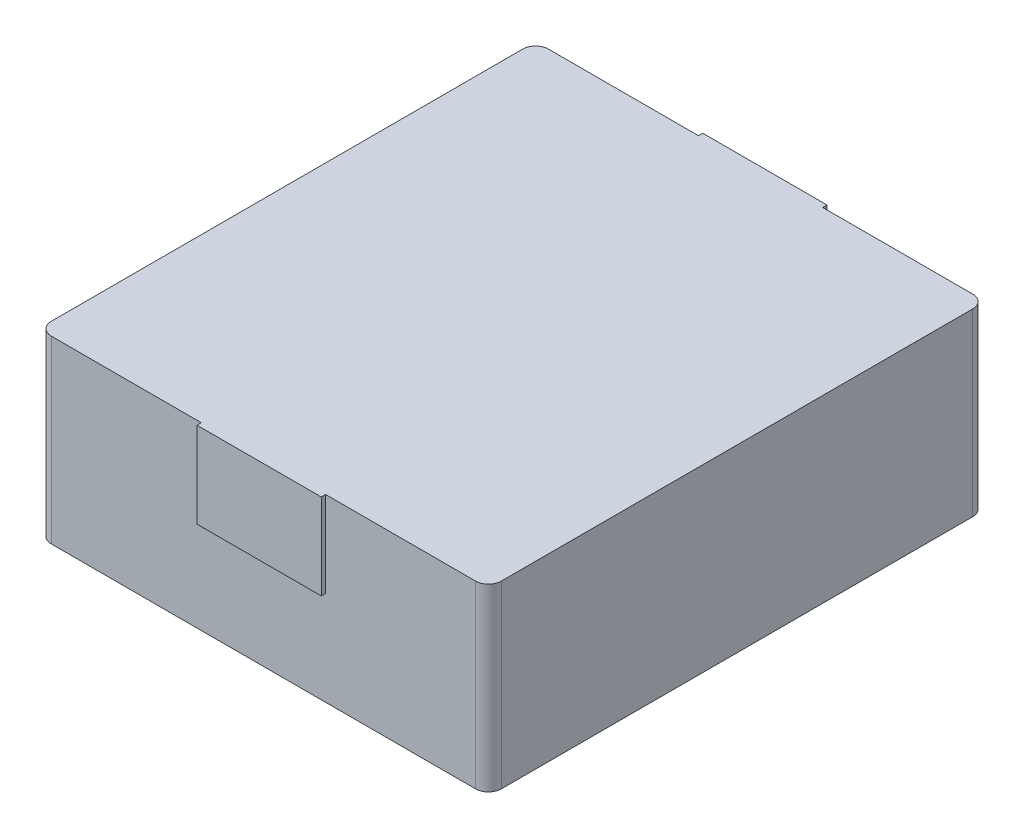
ISO-10303-21;
HEADER;
FILE_DESCRIPTION(('STEP AP214'),'2;1');
FILE_NAME('part.step','',(''),(''),'','','');
FILE_SCHEMA(('AUTOMOTIVE_DESIGN { 1 0 10303 214 1 1 1 1 }'));
ENDSEC;
DATA;
#1=APPLICATION_CONTEXT('core data for automotive mechanical design processes');
#2=APPLICATION_PROTOCOL_DEFINITION('international standard','automotive_design',2000,#1);
#3=PRODUCT_CONTEXT('',#1,'mechanical');
#4=PRODUCT('Part','Part','',(#3));
#5=PRODUCT_RELATED_PRODUCT_CATEGORY('part','',(#4));
#6=PRODUCT_DEFINITION_FORMATION('','',#4);
#7=PRODUCT_DEFINITION_CONTEXT('part definition',#1,'design');
#8=PRODUCT_DEFINITION('design','',#6,#7);
#9=PRODUCT_DEFINITION_SHAPE('','',#8);
#10=(LENGTH_UNIT() NAMED_UNIT(*) SI_UNIT(.MILLI.,.METRE.));
#11=(NAMED_UNIT(*) PLANE_ANGLE_UNIT() SI_UNIT($,.RADIAN.));
#12=(NAMED_UNIT(*) SI_UNIT($,.STERADIAN.) SOLID_ANGLE_UNIT());
#13=UNCERTAINTY_MEASURE_WITH_UNIT(LENGTH_MEASURE(1.E-05),#10,'distance_accuracy_value','');
#14=(GEOMETRIC_REPRESENTATION_CONTEXT(3) GLOBAL_UNCERTAINTY_ASSIGNED_CONTEXT((#13)) GLOBAL_UNIT_ASSIGNED_CONTEXT((#10,
#11,#12)) REPRESENTATION_CONTEXT('',''));
#15=CARTESIAN_POINT('',(0.,0.,0.));
#16=DIRECTION('',(0.,0.,1.));
#17=DIRECTION('',(1.,0.,0.));
#18=AXIS2_PLACEMENT_3D('',#15,#16,#17);
#19=CARTESIAN_POINT('',(24.35,5.75,-11.25));
#20=DIRECTION('',(0.,1.,0.));
#21=DIRECTION('',(0.,0.,-1.));
#22=AXIS2_PLACEMENT_3D('',#19,#20,#21);
#23=PLANE('',#22);
#24=DIRECTION('',(0.,0.,-1.));
#25=VECTOR('',#24,1.);
#26=CARTESIAN_POINT('',(21.45,5.75,-11.3));
#27=LINE('',#26,#25);
#28=CARTESIAN_POINT('',(21.45,5.75,-11.25));
#29=VERTEX_POINT('',#28);
#30=CARTESIAN_POINT('',(21.45,5.75,-11.35));
#31=VERTEX_POINT('',#30);
#32=EDGE_CURVE('E200',#29,#31,#27,.T.);
#33=ORIENTED_EDGE('',*,*,#32,.T.);
#34=DIRECTION('',(-1.,0.,0.));
#35=VECTOR('',#34,1.);
#36=CARTESIAN_POINT('',(22.9,5.75,-11.35));
#37=LINE('',#36,#35);
#38=CARTESIAN_POINT('',(24.35,5.75,-11.35));
#39=VERTEX_POINT('',#38);
#40=EDGE_CURVE('E152',#39,#31,#37,.T.);
#41=ORIENTED_EDGE('',*,*,#40,.F.);
#42=DIRECTION('',(0.,0.,1.));
#43=VECTOR('',#42,1.);
#44=CARTESIAN_POINT('',(24.35,5.75,-11.3));
#45=LINE('',#44,#43);
#46=CARTESIAN_POINT('',(24.35,5.75,-11.25));
#47=VERTEX_POINT('',#46);
#48=EDGE_CURVE('E199',#39,#47,#45,.T.);
#49=ORIENTED_EDGE('',*,*,#48,.T.);
#50=DIRECTION('',(-1.,0.,0.));
#51=VECTOR('',#50,1.);
#52=CARTESIAN_POINT('',(22.9,5.75,-11.25));
#53=LINE('',#52,#51);
#54=EDGE_CURVE('E240',#47,#29,#53,.T.);
#55=ORIENTED_EDGE('',*,*,#54,.T.);
#56=EDGE_LOOP('',(#33,#41,#49,#55));
#57=FACE_BOUND('',#56,.T.);
#58=ADVANCED_FACE('F17',(#57),#23,.F.);
#59=CARTESIAN_POINT('',(21.45,7.75,-11.35));
#60=DIRECTION('',(1.,0.,0.));
#61=DIRECTION('',(0.,0.,1.));
#62=AXIS2_PLACEMENT_3D('',#59,#60,#61);
#63=PLANE('',#62);
#64=ORIENTED_EDGE('',*,*,#32,.F.);
#65=DIRECTION('',(0.,1.,0.));
#66=VECTOR('',#65,1.);
#67=CARTESIAN_POINT('',(21.45,6.75,-11.25));
#68=LINE('',#67,#66);
#69=CARTESIAN_POINT('',(21.45,7.75,-11.25));
#70=VERTEX_POINT('',#69);
#71=EDGE_CURVE('E209',#29,#70,#68,.T.);
#72=ORIENTED_EDGE('',*,*,#71,.T.);
#73=DIRECTION('',(0.,0.,1.));
#74=VECTOR('',#73,1.);
#75=CARTESIAN_POINT('',(21.45,7.75,-11.3));
#76=LINE('',#75,#74);
#77=CARTESIAN_POINT('',(21.45,7.75,-11.35));
#78=VERTEX_POINT('',#77);
#79=EDGE_CURVE('E71',#78,#70,#76,.T.);
#80=ORIENTED_EDGE('',*,*,#79,.F.);
#81=DIRECTION('',(0.,1.,0.));
#82=VECTOR('',#81,1.);
#83=CARTESIAN_POINT('',(21.45,5.65,-11.35));
#84=LINE('',#83,#82);
#85=EDGE_CURVE('E150',#31,#78,#84,.T.);
#86=ORIENTED_EDGE('',*,*,#85,.F.);
#87=EDGE_LOOP('',(#64,#72,#80,#86));
#88=FACE_BOUND('',#87,.T.);
#89=ADVANCED_FACE('F327',(#88),#63,.F.);
#90=CARTESIAN_POINT('',(24.35,7.75,-11.25));
#91=DIRECTION('',(-1.,0.,0.));
#92=DIRECTION('',(0.,0.,-1.));
#93=AXIS2_PLACEMENT_3D('',#90,#91,#92);
#94=PLANE('',#93);
#95=ORIENTED_EDGE('',*,*,#48,.F.);
#96=DIRECTION('',(0.,-1.,0.));
#97=VECTOR('',#96,1.);
#98=CARTESIAN_POINT('',(24.35,5.65,-11.35));
#99=LINE('',#98,#97);
#100=CARTESIAN_POINT('',(24.35,7.75,-11.35));
#101=VERTEX_POINT('',#100);
#102=EDGE_CURVE('E146',#101,#39,#99,.T.);
#103=ORIENTED_EDGE('',*,*,#102,.F.);
#104=DIRECTION('',(0.,0.,-1.));
#105=VECTOR('',#104,1.);
#106=CARTESIAN_POINT('',(24.35,7.75,-11.3));
#107=LINE('',#106,#105);
#108=CARTESIAN_POINT('',(24.35,7.75,-11.25));
#109=VERTEX_POINT('',#108);
#110=EDGE_CURVE('E196',#109,#101,#107,.T.);
#111=ORIENTED_EDGE('',*,*,#110,.F.);
#112=DIRECTION('',(0.,-1.,0.));
#113=VECTOR('',#112,1.);
#114=CARTESIAN_POINT('',(24.35,6.75,-11.25));
#115=LINE('',#114,#113);
#116=EDGE_CURVE('E243',#109,#47,#115,.T.);
#117=ORIENTED_EDGE('',*,*,#116,.T.);
#118=EDGE_LOOP('',(#95,#103,#111,#117));
#119=FACE_BOUND('',#118,.T.);
#120=ADVANCED_FACE('F317',(#119),#94,.F.);
#121=CARTESIAN_POINT('',(17.95,3.55,-11.65));
#122=DIRECTION('',(0.,1.,0.));
#123=DIRECTION('',(0.,0.,1.));
#124=AXIS2_PLACEMENT_3D('',#121,#122,#123);
#125=CYLINDRICAL_SURFACE('',#124,0.300000000000002);
#126=CARTESIAN_POINT('',(17.95,3.55,-11.65));
#127=DIRECTION('',(0.,1.,0.));
#128=DIRECTION('',(0.,0.,1.));
#129=AXIS2_PLACEMENT_3D('',#126,#127,#128);
#130=CIRCLE('',#129,0.300000000000002);
#131=CARTESIAN_POINT('',(17.95,3.55,-11.35));
#132=VERTEX_POINT('',#131);
#133=CARTESIAN_POINT('',(17.65,3.55,-11.65));
#134=VERTEX_POINT('',#133);
#135=EDGE_CURVE('E248',#132,#134,#130,.F.);
#136=ORIENTED_EDGE('',*,*,#135,.F.);
#137=DIRECTION('',(0.,-1.,0.));
#138=VECTOR('',#137,1.);
#139=CARTESIAN_POINT('',(17.95,5.65,-11.35));
#140=LINE('',#139,#138);
#141=CARTESIAN_POINT('',(17.95,7.75,-11.35));
#142=VERTEX_POINT('',#141);
#143=EDGE_CURVE('E147',#142,#132,#140,.T.);
#144=ORIENTED_EDGE('',*,*,#143,.F.);
#145=CARTESIAN_POINT('',(17.95,7.75,-11.65));
#146=DIRECTION('',(0.,1.,0.));
#147=DIRECTION('',(0.,0.,1.));
#148=AXIS2_PLACEMENT_3D('',#145,#146,#147);
#149=CIRCLE('',#148,0.300000000000002);
#150=CARTESIAN_POINT('',(17.65,7.75,-11.65));
#151=VERTEX_POINT('',#150);
#152=EDGE_CURVE('E21',#151,#142,#149,.T.);
#153=ORIENTED_EDGE('',*,*,#152,.F.);
#154=DIRECTION('',(0.,1.,0.));
#155=VECTOR('',#154,1.);
#156=CARTESIAN_POINT('',(17.65,5.65,-11.65));
#157=LINE('',#156,#155);
#158=EDGE_CURVE('E141',#134,#151,#157,.T.);
#159=ORIENTED_EDGE('',*,*,#158,.F.);
#160=EDGE_LOOP('',(#136,#144,#153,#159));
#161=FACE_BOUND('',#160,.T.);
#162=ADVANCED_FACE('F314',(#161),#125,.T.);
#163=CARTESIAN_POINT('',(24.35,5.75,-23.05));
#164=DIRECTION('',(0.,-1.,0.));
#165=DIRECTION('',(0.,0.,1.));
#166=AXIS2_PLACEMENT_3D('',#163,#164,#165);
#167=PLANE('',#166);
#168=DIRECTION('',(-1.,0.,0.));
#169=VECTOR('',#168,1.);
#170=CARTESIAN_POINT('',(22.9,5.75,-23.05));
#171=LINE('',#170,#169);
#172=CARTESIAN_POINT('',(24.35,5.75,-23.05));
#173=VERTEX_POINT('',#172);
#174=CARTESIAN_POINT('',(21.45,5.75,-23.05));
#175=VERTEX_POINT('',#174);
#176=EDGE_CURVE('E221',#173,#175,#171,.T.);
#177=ORIENTED_EDGE('',*,*,#176,.F.);
#178=DIRECTION('',(0.,0.,-1.));
#179=VECTOR('',#178,1.);
#180=CARTESIAN_POINT('',(24.35,5.75,-23.));
#181=LINE('',#180,#179);
#182=CARTESIAN_POINT('',(24.35,5.75,-22.95));
#183=VERTEX_POINT('',#182);
#184=EDGE_CURVE('E188',#183,#173,#181,.T.);
#185=ORIENTED_EDGE('',*,*,#184,.F.);
#186=DIRECTION('',(1.,0.,0.));
#187=VECTOR('',#186,1.);
#188=CARTESIAN_POINT('',(22.9,5.75,-22.95));
#189=LINE('',#188,#187);
#190=CARTESIAN_POINT('',(21.45,5.75,-22.95));
#191=VERTEX_POINT('',#190);
#192=EDGE_CURVE('E178',#191,#183,#189,.T.);
#193=ORIENTED_EDGE('',*,*,#192,.F.);
#194=DIRECTION('',(0.,0.,1.));
#195=VECTOR('',#194,1.);
#196=CARTESIAN_POINT('',(21.45,5.75,-23.));
#197=LINE('',#196,#195);
#198=EDGE_CURVE('E170',#175,#191,#197,.T.);
#199=ORIENTED_EDGE('',*,*,#198,.F.);
#200=EDGE_LOOP('',(#177,#185,#193,#199));
#201=FACE_BOUND('',#200,.T.);
#202=ADVANCED_FACE('F316',(#201),#167,.T.);
#203=CARTESIAN_POINT('',(24.35,7.75,-23.05));
#204=DIRECTION('',(1.,0.,0.));
#205=DIRECTION('',(0.,0.,1.));
#206=AXIS2_PLACEMENT_3D('',#203,#204,#205);
#207=PLANE('',#206);
#208=DIRECTION('',(0.,-1.,0.));
#209=VECTOR('',#208,1.);
#210=CARTESIAN_POINT('',(24.35,6.75,-23.05));
#211=LINE('',#210,#209);
#212=CARTESIAN_POINT('',(24.35,7.75,-23.05));
#213=VERTEX_POINT('',#212);
#214=EDGE_CURVE('E143',#213,#173,#211,.T.);
#215=ORIENTED_EDGE('',*,*,#214,.F.);
#216=DIRECTION('',(0.,0.,1.));
#217=VECTOR('',#216,1.);
#218=CARTESIAN_POINT('',(24.35,7.75,-23.));
#219=LINE('',#218,#217);
#220=CARTESIAN_POINT('',(24.35,7.75,-22.95));
#221=VERTEX_POINT('',#220);
#222=EDGE_CURVE('E185',#213,#221,#219,.T.);
#223=ORIENTED_EDGE('',*,*,#222,.T.);
#224=DIRECTION('',(0.,1.,0.));
#225=VECTOR('',#224,1.);
#226=CARTESIAN_POINT('',(24.35,5.65,-22.95));
#227=LINE('',#226,#225);
#228=EDGE_CURVE('E181',#183,#221,#227,.T.);
#229=ORIENTED_EDGE('',*,*,#228,.F.);
#230=ORIENTED_EDGE('',*,*,#184,.T.);
#231=EDGE_LOOP('',(#215,#223,#229,#230));
#232=FACE_BOUND('',#231,.T.);
#233=ADVANCED_FACE('F324',(#232),#207,.T.);
#234=CARTESIAN_POINT('',(17.95,3.55,-22.65));
#235=DIRECTION('',(0.,1.,0.));
#236=DIRECTION('',(-1.,0.,0.));
#237=AXIS2_PLACEMENT_3D('',#234,#235,#236);
#238=CYLINDRICAL_SURFACE('',#237,0.299999999999995);
#239=CARTESIAN_POINT('',(17.95,3.55,-22.65));
#240=DIRECTION('',(0.,1.,0.));
#241=DIRECTION('',(-1.,0.,0.));
#242=AXIS2_PLACEMENT_3D('',#239,#240,#241);
#243=CIRCLE('',#242,0.299999999999995);
#244=CARTESIAN_POINT('',(17.65,3.55,-22.65));
#245=VERTEX_POINT('',#244);
#246=CARTESIAN_POINT('',(17.95,3.55,-22.95));
#247=VERTEX_POINT('',#246);
#248=EDGE_CURVE('E106',#245,#247,#243,.F.);
#249=ORIENTED_EDGE('',*,*,#248,.F.);
#250=DIRECTION('',(0.,-1.,0.));
#251=VECTOR('',#250,1.);
#252=CARTESIAN_POINT('',(17.65,5.65,-22.65));
#253=LINE('',#252,#251);
#254=CARTESIAN_POINT('',(17.65,7.75,-22.65));
#255=VERTEX_POINT('',#254);
#256=EDGE_CURVE('E144',#255,#245,#253,.T.);
#257=ORIENTED_EDGE('',*,*,#256,.F.);
#258=CARTESIAN_POINT('',(17.95,7.75,-22.65));
#259=DIRECTION('',(0.,1.,0.));
#260=DIRECTION('',(-1.,0.,0.));
#261=AXIS2_PLACEMENT_3D('',#258,#259,#260);
#262=CIRCLE('',#261,0.299999999999995);
#263=CARTESIAN_POINT('',(17.95,7.75,-22.95));
#264=VERTEX_POINT('',#263);
#265=EDGE_CURVE('E129',#264,#255,#262,.T.);
#266=ORIENTED_EDGE('',*,*,#265,.F.);
#267=DIRECTION('',(0.,1.,0.));
#268=VECTOR('',#267,1.);
#269=CARTESIAN_POINT('',(17.95,5.65,-22.95));
#270=LINE('',#269,#268);
#271=EDGE_CURVE('E121',#247,#264,#270,.T.);
#272=ORIENTED_EDGE('',*,*,#271,.F.);
#273=EDGE_LOOP('',(#249,#257,#266,#272));
#274=FACE_BOUND('',#273,.T.);
#275=ADVANCED_FACE('F128',(#274),#238,.T.);
#276=CARTESIAN_POINT('',(21.45,7.75,-22.95));
#277=DIRECTION('',(-1.,0.,0.));
#278=DIRECTION('',(0.,0.,-1.));
#279=AXIS2_PLACEMENT_3D('',#276,#277,#278);
#280=PLANE('',#279);
#281=DIRECTION('',(0.,1.,0.));
#282=VECTOR('',#281,1.);
#283=CARTESIAN_POINT('',(21.45,6.75,-23.05));
#284=LINE('',#283,#282);
#285=CARTESIAN_POINT('',(21.45,7.75,-23.05));
#286=VERTEX_POINT('',#285);
#287=EDGE_CURVE('E182',#175,#286,#284,.T.);
#288=ORIENTED_EDGE('',*,*,#287,.F.);
#289=ORIENTED_EDGE('',*,*,#198,.T.);
#290=DIRECTION('',(0.,-1.,0.));
#291=VECTOR('',#290,1.);
#292=CARTESIAN_POINT('',(21.45,5.65,-22.95));
#293=LINE('',#292,#291);
#294=CARTESIAN_POINT('',(21.45,7.75,-22.95));
#295=VERTEX_POINT('',#294);
#296=EDGE_CURVE('E130',#295,#191,#293,.T.);
#297=ORIENTED_EDGE('',*,*,#296,.F.);
#298=DIRECTION('',(0.,0.,-1.));
#299=VECTOR('',#298,1.);
#300=CARTESIAN_POINT('',(21.45,7.75,-23.));
#301=LINE('',#300,#299);
#302=EDGE_CURVE('E167',#295,#286,#301,.T.);
#303=ORIENTED_EDGE('',*,*,#302,.T.);
#304=EDGE_LOOP('',(#288,#289,#297,#303));
#305=FACE_BOUND('',#304,.T.);
#306=ADVANCED_FACE('F355',(#305),#280,.T.);
#307=CARTESIAN_POINT('',(27.85,3.55,-22.65));
#308=DIRECTION('',(0.,1.,0.));
#309=DIRECTION('',(0.,0.,1.));
#310=AXIS2_PLACEMENT_3D('',#307,#308,#309);
#311=CYLINDRICAL_SURFACE('',#310,0.299999999999991);
#312=CARTESIAN_POINT('',(27.85,3.55,-22.65));
#313=DIRECTION('',(0.,1.,0.));
#314=DIRECTION('',(0.,0.,1.));
#315=AXIS2_PLACEMENT_3D('',#312,#313,#314);
#316=CIRCLE('',#315,0.299999999999991);
#317=CARTESIAN_POINT('',(27.85,3.55,-22.95));
#318=VERTEX_POINT('',#317);
#319=CARTESIAN_POINT('',(28.15,3.55,-22.65));
#320=VERTEX_POINT('',#319);
#321=EDGE_CURVE('E115',#318,#320,#316,.F.);
#322=ORIENTED_EDGE('',*,*,#321,.F.);
#323=DIRECTION('',(0.,-1.,0.));
#324=VECTOR('',#323,1.);
#325=CARTESIAN_POINT('',(27.85,5.65,-22.95));
#326=LINE('',#325,#324);
#327=CARTESIAN_POINT('',(27.85,7.75,-22.95));
#328=VERTEX_POINT('',#327);
#329=EDGE_CURVE('E125',#328,#318,#326,.T.);
#330=ORIENTED_EDGE('',*,*,#329,.F.);
#331=CARTESIAN_POINT('',(27.85,7.75,-22.65));
#332=DIRECTION('',(0.,1.,0.));
#333=DIRECTION('',(0.,0.,1.));
#334=AXIS2_PLACEMENT_3D('',#331,#332,#333);
#335=CIRCLE('',#334,0.299999999999991);
#336=CARTESIAN_POINT('',(28.15,7.75,-22.65));
#337=VERTEX_POINT('',#336);
#338=EDGE_CURVE('E175',#337,#328,#335,.T.);
#339=ORIENTED_EDGE('',*,*,#338,.F.);
#340=DIRECTION('',(0.,1.,0.));
#341=VECTOR('',#340,1.);
#342=CARTESIAN_POINT('',(28.15,5.65,-22.65));
#343=LINE('',#342,#341);
#344=EDGE_CURVE('E133',#320,#337,#343,.T.);
#345=ORIENTED_EDGE('',*,*,#344,.F.);
#346=EDGE_LOOP('',(#322,#330,#339,#345));
#347=FACE_BOUND('',#346,.T.);
#348=ADVANCED_FACE('F302',(#347),#311,.T.);
#349=CARTESIAN_POINT('',(27.85,3.55,-11.65));
#350=DIRECTION('',(0.,1.,0.));
#351=DIRECTION('',(-1.,0.,0.));
#352=AXIS2_PLACEMENT_3D('',#349,#350,#351);
#353=CYLINDRICAL_SURFACE('',#352,0.3);
#354=CARTESIAN_POINT('',(27.85,3.55,-11.65));
#355=DIRECTION('',(0.,1.,0.));
#356=DIRECTION('',(-1.,0.,0.));
#357=AXIS2_PLACEMENT_3D('',#354,#355,#356);
#358=CIRCLE('',#357,0.3);
#359=CARTESIAN_POINT('',(28.15,3.55,-11.65));
#360=VERTEX_POINT('',#359);
#361=CARTESIAN_POINT('',(27.85,3.55,-11.35));
#362=VERTEX_POINT('',#361);
#363=EDGE_CURVE('E261',#360,#362,#358,.F.);
#364=ORIENTED_EDGE('',*,*,#363,.F.);
#365=DIRECTION('',(0.,-1.,0.));
#366=VECTOR('',#365,1.);
#367=CARTESIAN_POINT('',(28.15,5.65,-11.65));
#368=LINE('',#367,#366);
#369=CARTESIAN_POINT('',(28.15,7.75,-11.65));
#370=VERTEX_POINT('',#369);
#371=EDGE_CURVE('E166',#370,#360,#368,.T.);
#372=ORIENTED_EDGE('',*,*,#371,.F.);
#373=CARTESIAN_POINT('',(27.85,7.75,-11.65));
#374=DIRECTION('',(0.,1.,0.));
#375=DIRECTION('',(-1.,0.,0.));
#376=AXIS2_PLACEMENT_3D('',#373,#374,#375);
#377=CIRCLE('',#376,0.3);
#378=CARTESIAN_POINT('',(27.85,7.75,-11.35));
#379=VERTEX_POINT('',#378);
#380=EDGE_CURVE('E36',#379,#370,#377,.T.);
#381=ORIENTED_EDGE('',*,*,#380,.F.);
#382=DIRECTION('',(0.,1.,0.));
#383=VECTOR('',#382,1.);
#384=CARTESIAN_POINT('',(27.85,5.65,-11.35));
#385=LINE('',#384,#383);
#386=EDGE_CURVE('E155',#362,#379,#385,.T.);
#387=ORIENTED_EDGE('',*,*,#386,.F.);
#388=EDGE_LOOP('',(#364,#372,#381,#387));
#389=FACE_BOUND('',#388,.T.);
#390=ADVANCED_FACE('F309',(#389),#353,.T.);
#391=CARTESIAN_POINT('',(28.25605,3.55,-23.066));
#392=DIRECTION('',(0.,-1.,0.));
#393=DIRECTION('',(0.,0.,1.));
#394=AXIS2_PLACEMENT_3D('',#391,#392,#393);
#395=PLANE('',#394);
#396=ORIENTED_EDGE('',*,*,#135,.T.);
#397=DIRECTION('',(0.,0.,1.));
#398=VECTOR('',#397,1.);
#399=CARTESIAN_POINT('',(17.65,3.55,-17.15));
#400=LINE('',#399,#398);
#401=EDGE_CURVE('E111',#245,#134,#400,.T.);
#402=ORIENTED_EDGE('',*,*,#401,.F.);
#403=ORIENTED_EDGE('',*,*,#248,.T.);
#404=DIRECTION('',(-1.,0.,0.));
#405=VECTOR('',#404,1.);
#406=CARTESIAN_POINT('',(22.9,3.55,-22.95));
#407=LINE('',#406,#405);
#408=EDGE_CURVE('E109',#318,#247,#407,.T.);
#409=ORIENTED_EDGE('',*,*,#408,.F.);
#410=ORIENTED_EDGE('',*,*,#321,.T.);
#411=DIRECTION('',(0.,0.,-1.));
#412=VECTOR('',#411,1.);
#413=CARTESIAN_POINT('',(28.15,3.55,-17.15));
#414=LINE('',#413,#412);
#415=EDGE_CURVE('E162',#360,#320,#414,.T.);
#416=ORIENTED_EDGE('',*,*,#415,.F.);
#417=ORIENTED_EDGE('',*,*,#363,.T.);
#418=DIRECTION('',(1.,0.,0.));
#419=VECTOR('',#418,1.);
#420=CARTESIAN_POINT('',(22.9,3.55,-11.35));
#421=LINE('',#420,#419);
#422=EDGE_CURVE('E149',#132,#362,#421,.T.);
#423=ORIENTED_EDGE('',*,*,#422,.F.);
#424=EDGE_LOOP('',(#396,#402,#403,#409,#410,#416,#417,#423));
#425=FACE_BOUND('',#424,.T.);
#426=ADVANCED_FACE('F108',(#425),#395,.T.);
#427=CARTESIAN_POINT('',(21.45,7.75,-11.25));
#428=DIRECTION('',(0.,0.,-1.));
#429=DIRECTION('',(1.,0.,0.));
#430=AXIS2_PLACEMENT_3D('',#427,#428,#429);
#431=PLANE('',#430);
#432=ORIENTED_EDGE('',*,*,#54,.F.);
#433=ORIENTED_EDGE('',*,*,#116,.F.);
#434=DIRECTION('',(-1.,0.,0.));
#435=VECTOR('',#434,1.);
#436=CARTESIAN_POINT('',(22.900525,7.75,-11.25));
#437=LINE('',#436,#435);
#438=EDGE_CURVE('E251',#109,#70,#437,.T.);
#439=ORIENTED_EDGE('',*,*,#438,.T.);
#440=ORIENTED_EDGE('',*,*,#71,.F.);
#441=EDGE_LOOP('',(#432,#433,#439,#440));
#442=FACE_BOUND('',#441,.T.);
#443=ADVANCED_FACE('F349',(#442),#431,.F.);
#444=CARTESIAN_POINT('',(27.85,7.75,-11.35));
#445=DIRECTION('',(0.,0.,1.));
#446=DIRECTION('',(-1.,0.,0.));
#447=AXIS2_PLACEMENT_3D('',#444,#445,#446);
#448=PLANE('',#447);
#449=DIRECTION('',(-1.,0.,0.));
#450=VECTOR('',#449,1.);
#451=CARTESIAN_POINT('',(22.900525,7.75,-11.35));
#452=LINE('',#451,#450);
#453=EDGE_CURVE('E165',#379,#101,#452,.T.);
#454=ORIENTED_EDGE('',*,*,#453,.T.);
#455=ORIENTED_EDGE('',*,*,#102,.T.);
#456=ORIENTED_EDGE('',*,*,#40,.T.);
#457=ORIENTED_EDGE('',*,*,#85,.T.);
#458=DIRECTION('',(-1.,0.,0.));
#459=VECTOR('',#458,1.);
#460=CARTESIAN_POINT('',(22.900525,7.75,-11.35));
#461=LINE('',#460,#459);
#462=EDGE_CURVE('E254',#78,#142,#461,.T.);
#463=ORIENTED_EDGE('',*,*,#462,.T.);
#464=ORIENTED_EDGE('',*,*,#143,.T.);
#465=ORIENTED_EDGE('',*,*,#422,.T.);
#466=ORIENTED_EDGE('',*,*,#386,.T.);
#467=EDGE_LOOP('',(#454,#455,#456,#457,#463,#464,#465,#466));
#468=FACE_BOUND('',#467,.T.);
#469=ADVANCED_FACE('F312',(#468),#448,.T.);
#470=CARTESIAN_POINT('',(17.65,7.75,-11.65));
#471=DIRECTION('',(-1.,0.,0.));
#472=DIRECTION('',(0.,0.,-1.));
#473=AXIS2_PLACEMENT_3D('',#470,#471,#472);
#474=PLANE('',#473);
#475=ORIENTED_EDGE('',*,*,#158,.T.);
#476=DIRECTION('',(0.,0.,-1.));
#477=VECTOR('',#476,1.);
#478=CARTESIAN_POINT('',(17.65,7.75,-17.15));
#479=LINE('',#478,#477);
#480=EDGE_CURVE('E266',#151,#255,#479,.T.);
#481=ORIENTED_EDGE('',*,*,#480,.T.);
#482=ORIENTED_EDGE('',*,*,#256,.T.);
#483=ORIENTED_EDGE('',*,*,#401,.T.);
#484=EDGE_LOOP('',(#475,#481,#482,#483));
#485=FACE_BOUND('',#484,.T.);
#486=ADVANCED_FACE('F269',(#485),#474,.T.);
#487=CARTESIAN_POINT('',(21.45,7.75,-23.05));
#488=DIRECTION('',(0.,0.,-1.));
#489=DIRECTION('',(1.,0.,0.));
#490=AXIS2_PLACEMENT_3D('',#487,#488,#489);
#491=PLANE('',#490);
#492=ORIENTED_EDGE('',*,*,#176,.T.);
#493=ORIENTED_EDGE('',*,*,#287,.T.);
#494=DIRECTION('',(1.,0.,0.));
#495=VECTOR('',#494,1.);
#496=CARTESIAN_POINT('',(22.900525,7.75,-23.05));
#497=LINE('',#496,#495);
#498=EDGE_CURVE('E230',#286,#213,#497,.T.);
#499=ORIENTED_EDGE('',*,*,#498,.T.);
#500=ORIENTED_EDGE('',*,*,#214,.T.);
#501=EDGE_LOOP('',(#492,#493,#499,#500));
#502=FACE_BOUND('',#501,.T.);
#503=ADVANCED_FACE('F339',(#502),#491,.T.);
#504=CARTESIAN_POINT('',(17.95,7.75,-22.95));
#505=DIRECTION('',(0.,0.,-1.));
#506=DIRECTION('',(1.,0.,0.));
#507=AXIS2_PLACEMENT_3D('',#504,#505,#506);
#508=PLANE('',#507);
#509=DIRECTION('',(1.,0.,0.));
#510=VECTOR('',#509,1.);
#511=CARTESIAN_POINT('',(22.900525,7.75,-22.95));
#512=LINE('',#511,#510);
#513=EDGE_CURVE('E233',#264,#295,#512,.T.);
#514=ORIENTED_EDGE('',*,*,#513,.T.);
#515=ORIENTED_EDGE('',*,*,#296,.T.);
#516=ORIENTED_EDGE('',*,*,#192,.T.);
#517=ORIENTED_EDGE('',*,*,#228,.T.);
#518=DIRECTION('',(1.,0.,0.));
#519=VECTOR('',#518,1.);
#520=CARTESIAN_POINT('',(22.900525,7.75,-22.95));
#521=LINE('',#520,#519);
#522=EDGE_CURVE('E27',#221,#328,#521,.T.);
#523=ORIENTED_EDGE('',*,*,#522,.T.);
#524=ORIENTED_EDGE('',*,*,#329,.T.);
#525=ORIENTED_EDGE('',*,*,#408,.T.);
#526=ORIENTED_EDGE('',*,*,#271,.T.);
#527=EDGE_LOOP('',(#514,#515,#516,#517,#523,#524,#525,#526));
#528=FACE_BOUND('',#527,.T.);
#529=ADVANCED_FACE('F120',(#528),#508,.T.);
#530=CARTESIAN_POINT('',(28.15,7.75,-22.65));
#531=DIRECTION('',(1.,0.,0.));
#532=DIRECTION('',(0.,0.,1.));
#533=AXIS2_PLACEMENT_3D('',#530,#531,#532);
#534=PLANE('',#533);
#535=ORIENTED_EDGE('',*,*,#371,.T.);
#536=ORIENTED_EDGE('',*,*,#415,.T.);
#537=ORIENTED_EDGE('',*,*,#344,.T.);
#538=DIRECTION('',(0.,0.,1.));
#539=VECTOR('',#538,1.);
#540=CARTESIAN_POINT('',(28.15,7.75,-17.15));
#541=LINE('',#540,#539);
#542=EDGE_CURVE('E11',#337,#370,#541,.T.);
#543=ORIENTED_EDGE('',*,*,#542,.T.);
#544=EDGE_LOOP('',(#535,#536,#537,#543));
#545=FACE_BOUND('',#544,.T.);
#546=ADVANCED_FACE('F305',(#545),#534,.T.);
#547=CARTESIAN_POINT('',(28.25605,7.75,-23.05));
#548=DIRECTION('',(0.,-1.,0.));
#549=DIRECTION('',(0.,0.,1.));
#550=AXIS2_PLACEMENT_3D('',#547,#548,#549);
#551=PLANE('',#550);
#552=ORIENTED_EDGE('',*,*,#542,.F.);
#553=ORIENTED_EDGE('',*,*,#338,.T.);
#554=ORIENTED_EDGE('',*,*,#522,.F.);
#555=ORIENTED_EDGE('',*,*,#222,.F.);
#556=ORIENTED_EDGE('',*,*,#498,.F.);
#557=ORIENTED_EDGE('',*,*,#302,.F.);
#558=ORIENTED_EDGE('',*,*,#513,.F.);
#559=ORIENTED_EDGE('',*,*,#265,.T.);
#560=ORIENTED_EDGE('',*,*,#480,.F.);
#561=ORIENTED_EDGE('',*,*,#152,.T.);
#562=ORIENTED_EDGE('',*,*,#462,.F.);
#563=ORIENTED_EDGE('',*,*,#79,.T.);
#564=ORIENTED_EDGE('',*,*,#438,.F.);
#565=ORIENTED_EDGE('',*,*,#110,.T.);
#566=ORIENTED_EDGE('',*,*,#453,.F.);
#567=ORIENTED_EDGE('',*,*,#380,.T.);
#568=EDGE_LOOP('',(#552,#553,#554,#555,#556,#557,#558,#559,#560,#561,#562,#563,#564,#565,#566,#567));
#569=FACE_BOUND('',#568,.T.);
#570=ADVANCED_FACE('F19',(#569),#551,.F.);
#571=CLOSED_SHELL('',(#58,#89,#120,#162,#202,#233,#275,#306,#348,#390,#426,#443,#469,#486,#503,
#529,#546,#570));
#572=MANIFOLD_SOLID_BREP('B1',#571);
#573=ADVANCED_BREP_SHAPE_REPRESENTATION('',(#18,#572),#14);
#574=SHAPE_DEFINITION_REPRESENTATION(#9,#573);
ENDSEC;
END-ISO-10303-21;
